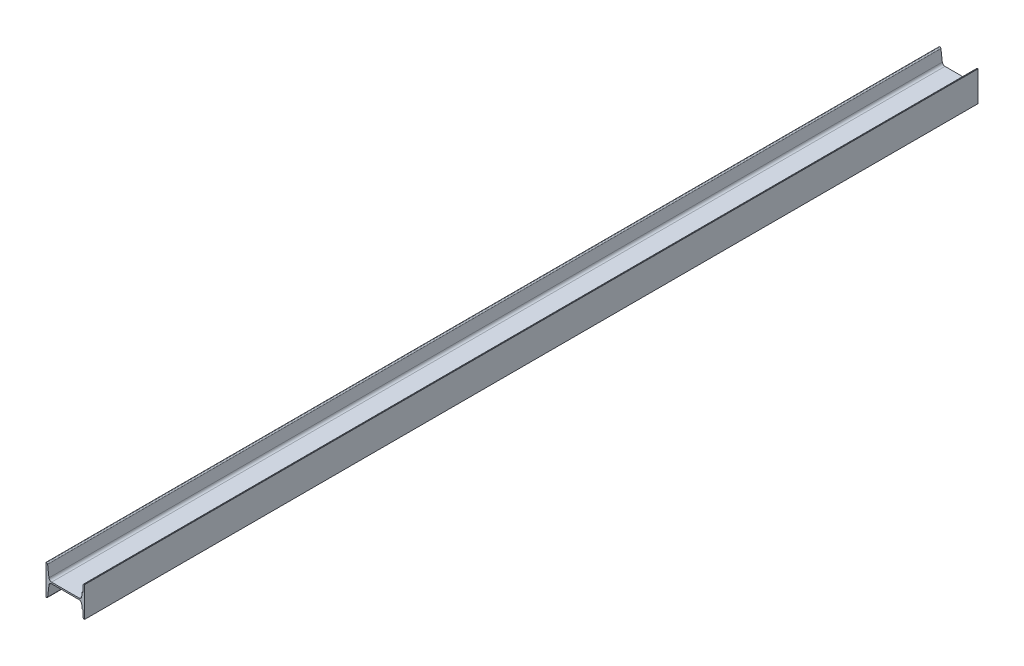
ISO-10303-21;
HEADER;
FILE_DESCRIPTION(('STEP AP214'),'2;1');
FILE_NAME('part.step','',(''),(''),'','','');
FILE_SCHEMA(('AUTOMOTIVE_DESIGN { 1 0 10303 214 1 1 1 1 }'));
ENDSEC;
DATA;
#1=APPLICATION_CONTEXT('core data for automotive mechanical design processes');
#2=APPLICATION_PROTOCOL_DEFINITION('international standard','automotive_design',2000,#1);
#3=PRODUCT_CONTEXT('',#1,'mechanical');
#4=PRODUCT('Part','Part','',(#3));
#5=PRODUCT_RELATED_PRODUCT_CATEGORY('part','',(#4));
#6=PRODUCT_DEFINITION_FORMATION('','',#4);
#7=PRODUCT_DEFINITION_CONTEXT('part definition',#1,'design');
#8=PRODUCT_DEFINITION('design','',#6,#7);
#9=PRODUCT_DEFINITION_SHAPE('','',#8);
#10=(LENGTH_UNIT() NAMED_UNIT(*) SI_UNIT(.MILLI.,.METRE.));
#11=(NAMED_UNIT(*) PLANE_ANGLE_UNIT() SI_UNIT($,.RADIAN.));
#12=(NAMED_UNIT(*) SI_UNIT($,.STERADIAN.) SOLID_ANGLE_UNIT());
#13=UNCERTAINTY_MEASURE_WITH_UNIT(LENGTH_MEASURE(1.E-05),#10,'distance_accuracy_value','');
#14=(GEOMETRIC_REPRESENTATION_CONTEXT(3) GLOBAL_UNCERTAINTY_ASSIGNED_CONTEXT((#13)) GLOBAL_UNIT_ASSIGNED_CONTEXT((#10,
#11,#12)) REPRESENTATION_CONTEXT('',''));
#15=CARTESIAN_POINT('',(0.,0.,0.));
#16=DIRECTION('',(0.,0.,1.));
#17=DIRECTION('',(1.,0.,0.));
#18=AXIS2_PLACEMENT_3D('',#15,#16,#17);
#19=CARTESIAN_POINT('',(112.531380140605,43.4991893124391,-1437.5));
#20=DIRECTION('',(0.,0.,1.));
#21=DIRECTION('',(1.,0.,0.));
#22=AXIS2_PLACEMENT_3D('',#19,#20,#21);
#23=CYLINDRICAL_SURFACE('',#22,3.3749999999963);
#24=CARTESIAN_POINT('',(112.531380140605,43.4991893124391,1337.5));
#25=DIRECTION('',(0.,0.,1.));
#26=DIRECTION('',(1.,0.,0.));
#27=AXIS2_PLACEMENT_3D('',#24,#25,#26);
#28=CIRCLE('',#27,3.3749999999963);
#29=CARTESIAN_POINT('',(112.531380140605,46.8741893124354,1337.5));
#30=VERTEX_POINT('',#29);
#31=CARTESIAN_POINT('',(109.709666996377,45.3508264074622,1337.5));
#32=VERTEX_POINT('',#31);
#33=EDGE_CURVE('E227',#30,#32,#28,.T.);
#34=ORIENTED_EDGE('',*,*,#33,.F.);
#35=DIRECTION('',(0.,0.,1.));
#36=VECTOR('',#35,1.);
#37=CARTESIAN_POINT('',(112.531380140605,46.8741893124354,-1437.5));
#38=LINE('',#37,#36);
#39=CARTESIAN_POINT('',(112.531380140605,46.8741893124354,-1437.5));
#40=VERTEX_POINT('',#39);
#41=EDGE_CURVE('E11',#40,#30,#38,.T.);
#42=ORIENTED_EDGE('',*,*,#41,.F.);
#43=CARTESIAN_POINT('',(112.531380140605,43.4991893124391,-1437.5));
#44=DIRECTION('',(0.,0.,1.));
#45=DIRECTION('',(1.,0.,0.));
#46=AXIS2_PLACEMENT_3D('',#43,#44,#45);
#47=CIRCLE('',#46,3.3749999999963);
#48=CARTESIAN_POINT('',(109.709666996377,45.3508264074622,-1437.5));
#49=VERTEX_POINT('',#48);
#50=EDGE_CURVE('E295',#40,#49,#47,.T.);
#51=ORIENTED_EDGE('',*,*,#50,.T.);
#52=DIRECTION('',(0.,0.,1.));
#53=VECTOR('',#52,1.);
#54=CARTESIAN_POINT('',(109.709666996377,45.3508264074622,-1437.5));
#55=LINE('',#54,#53);
#56=EDGE_CURVE('E37',#49,#32,#55,.T.);
#57=ORIENTED_EDGE('',*,*,#56,.T.);
#58=EDGE_LOOP('',(#34,#42,#51,#57));
#59=FACE_BOUND('',#58,.T.);
#60=ADVANCED_FACE('F34',(#59),#23,.T.);
#61=CARTESIAN_POINT('',(114.209666996383,46.8741893124354,-1437.5));
#62=DIRECTION('',(0.,1.,0.));
#63=DIRECTION('',(0.,0.,1.));
#64=AXIS2_PLACEMENT_3D('',#61,#62,#63);
#65=PLANE('',#64);
#66=DIRECTION('',(-1.,0.,0.));
#67=VECTOR('',#66,1.);
#68=CARTESIAN_POINT('',(114.209666996383,46.8741893124354,1337.5));
#69=LINE('',#68,#67);
#70=CARTESIAN_POINT('',(114.209666996383,46.8741893124354,1337.5));
#71=VERTEX_POINT('',#70);
#72=EDGE_CURVE('E293',#71,#30,#69,.T.);
#73=ORIENTED_EDGE('',*,*,#72,.F.);
#74=DIRECTION('',(0.,0.,1.));
#75=VECTOR('',#74,1.);
#76=CARTESIAN_POINT('',(114.209666996383,46.8741893124354,-1437.5));
#77=LINE('',#76,#75);
#78=CARTESIAN_POINT('',(114.209666996383,46.8741893124354,-1437.5));
#79=VERTEX_POINT('',#78);
#80=EDGE_CURVE('E43',#79,#71,#77,.T.);
#81=ORIENTED_EDGE('',*,*,#80,.F.);
#82=DIRECTION('',(-1.,0.,0.));
#83=VECTOR('',#82,1.);
#84=CARTESIAN_POINT('',(114.209666996383,46.8741893124354,-1437.5));
#85=LINE('',#84,#83);
#86=EDGE_CURVE('E217',#79,#40,#85,.T.);
#87=ORIENTED_EDGE('',*,*,#86,.T.);
#88=ORIENTED_EDGE('',*,*,#41,.T.);
#89=EDGE_LOOP('',(#73,#81,#87,#88));
#90=FACE_BOUND('',#89,.T.);
#91=ADVANCED_FACE('F339',(#90),#65,.T.);
#92=CARTESIAN_POINT('',(114.209666996383,-46.8758106875589,-1437.5));
#93=DIRECTION('',(1.,0.,0.));
#94=DIRECTION('',(0.,0.,-1.));
#95=AXIS2_PLACEMENT_3D('',#92,#93,#94);
#96=PLANE('',#95);
#97=DIRECTION('',(0.,1.,0.));
#98=VECTOR('',#97,1.);
#99=CARTESIAN_POINT('',(114.209666996383,-46.8758106875589,1337.5));
#100=LINE('',#99,#98);
#101=CARTESIAN_POINT('',(114.209666996383,-46.8758106875589,1337.5));
#102=VERTEX_POINT('',#101);
#103=EDGE_CURVE('E204',#102,#71,#100,.T.);
#104=ORIENTED_EDGE('',*,*,#103,.F.);
#105=DIRECTION('',(0.,0.,1.));
#106=VECTOR('',#105,1.);
#107=CARTESIAN_POINT('',(114.209666996383,-46.8758106875589,-1437.5));
#108=LINE('',#107,#106);
#109=CARTESIAN_POINT('',(114.209666996383,-46.8758106875589,-1437.5));
#110=VERTEX_POINT('',#109);
#111=EDGE_CURVE('E199',#110,#102,#108,.T.);
#112=ORIENTED_EDGE('',*,*,#111,.F.);
#113=DIRECTION('',(0.,1.,0.));
#114=VECTOR('',#113,1.);
#115=CARTESIAN_POINT('',(114.209666996383,-46.8758106875589,-1437.5));
#116=LINE('',#115,#114);
#117=EDGE_CURVE('E202',#110,#79,#116,.T.);
#118=ORIENTED_EDGE('',*,*,#117,.T.);
#119=ORIENTED_EDGE('',*,*,#80,.T.);
#120=EDGE_LOOP('',(#104,#112,#118,#119));
#121=FACE_BOUND('',#120,.T.);
#122=ADVANCED_FACE('F201',(#121),#96,.T.);
#123=CARTESIAN_POINT('',(112.531380140608,-46.8758106875589,-1437.5));
#124=DIRECTION('',(0.,-1.,0.));
#125=DIRECTION('',(0.,0.,-1.));
#126=AXIS2_PLACEMENT_3D('',#123,#124,#125);
#127=PLANE('',#126);
#128=DIRECTION('',(1.,0.,0.));
#129=VECTOR('',#128,1.);
#130=CARTESIAN_POINT('',(112.531380140608,-46.8758106875589,1337.5));
#131=LINE('',#130,#129);
#132=CARTESIAN_POINT('',(112.531380140608,-46.8758106875589,1337.5));
#133=VERTEX_POINT('',#132);
#134=EDGE_CURVE('E290',#133,#102,#131,.T.);
#135=ORIENTED_EDGE('',*,*,#134,.F.);
#136=DIRECTION('',(0.,0.,1.));
#137=VECTOR('',#136,1.);
#138=CARTESIAN_POINT('',(112.531380140608,-46.8758106875589,-1437.5));
#139=LINE('',#138,#137);
#140=CARTESIAN_POINT('',(112.531380140608,-46.8758106875589,-1437.5));
#141=VERTEX_POINT('',#140);
#142=EDGE_CURVE('E209',#141,#133,#139,.T.);
#143=ORIENTED_EDGE('',*,*,#142,.F.);
#144=DIRECTION('',(1.,0.,0.));
#145=VECTOR('',#144,1.);
#146=CARTESIAN_POINT('',(112.531380140608,-46.8758106875589,-1437.5));
#147=LINE('',#146,#145);
#148=EDGE_CURVE('E215',#141,#110,#147,.T.);
#149=ORIENTED_EDGE('',*,*,#148,.T.);
#150=ORIENTED_EDGE('',*,*,#111,.T.);
#151=EDGE_LOOP('',(#135,#143,#149,#150));
#152=FACE_BOUND('',#151,.T.);
#153=ADVANCED_FACE('F219',(#152),#127,.T.);
#154=CARTESIAN_POINT('',(112.531380140608,-43.5008106875589,-1437.5));
#155=DIRECTION('',(0.,0.,1.));
#156=DIRECTION('',(1.,0.,0.));
#157=AXIS2_PLACEMENT_3D('',#154,#155,#156);
#158=CYLINDRICAL_SURFACE('',#157,3.375);
#159=CARTESIAN_POINT('',(112.531380140608,-43.5008106875589,1337.5));
#160=DIRECTION('',(0.,0.,1.));
#161=DIRECTION('',(1.,0.,0.));
#162=AXIS2_PLACEMENT_3D('',#159,#160,#161);
#163=CIRCLE('',#162,3.375);
#164=CARTESIAN_POINT('',(109.709666996377,-45.3524477825839,1337.5));
#165=VERTEX_POINT('',#164);
#166=EDGE_CURVE('E287',#165,#133,#163,.T.);
#167=ORIENTED_EDGE('',*,*,#166,.F.);
#168=DIRECTION('',(0.,0.,1.));
#169=VECTOR('',#168,1.);
#170=CARTESIAN_POINT('',(109.709666996377,-45.3524477825839,-1437.5));
#171=LINE('',#170,#169);
#172=CARTESIAN_POINT('',(109.709666996377,-45.3524477825839,-1437.5));
#173=VERTEX_POINT('',#172);
#174=EDGE_CURVE('E299',#173,#165,#171,.T.);
#175=ORIENTED_EDGE('',*,*,#174,.F.);
#176=CARTESIAN_POINT('',(112.531380140608,-43.5008106875589,-1437.5));
#177=DIRECTION('',(0.,0.,1.));
#178=DIRECTION('',(1.,0.,0.));
#179=AXIS2_PLACEMENT_3D('',#176,#177,#178);
#180=CIRCLE('',#179,3.375);
#181=EDGE_CURVE('E220',#173,#141,#180,.T.);
#182=ORIENTED_EDGE('',*,*,#181,.T.);
#183=ORIENTED_EDGE('',*,*,#142,.T.);
#184=EDGE_LOOP('',(#167,#175,#182,#183));
#185=FACE_BOUND('',#184,.T.);
#186=ADVANCED_FACE('F352',(#185),#158,.T.);
#187=CARTESIAN_POINT('',(109.709666996377,-22.5008106875744,-1437.5));
#188=DIRECTION('',(-1.,0.,0.));
#189=DIRECTION('',(0.,0.,1.));
#190=AXIS2_PLACEMENT_3D('',#187,#188,#189);
#191=PLANE('',#190);
#192=DIRECTION('',(0.,-1.,0.));
#193=VECTOR('',#192,1.);
#194=CARTESIAN_POINT('',(109.709666996377,-22.5008106875744,1337.5));
#195=LINE('',#194,#193);
#196=CARTESIAN_POINT('',(109.709666996377,-22.5008106875744,1337.5));
#197=VERTEX_POINT('',#196);
#198=EDGE_CURVE('E284',#197,#165,#195,.T.);
#199=ORIENTED_EDGE('',*,*,#198,.F.);
#200=DIRECTION('',(0.,0.,1.));
#201=VECTOR('',#200,1.);
#202=CARTESIAN_POINT('',(109.709666996377,-22.5008106875744,-1437.5));
#203=LINE('',#202,#201);
#204=CARTESIAN_POINT('',(109.709666996377,-22.5008106875744,-1437.5));
#205=VERTEX_POINT('',#204);
#206=EDGE_CURVE('E301',#205,#197,#203,.T.);
#207=ORIENTED_EDGE('',*,*,#206,.F.);
#208=DIRECTION('',(0.,-1.,0.));
#209=VECTOR('',#208,1.);
#210=CARTESIAN_POINT('',(109.709666996377,-22.5008106875744,-1437.5));
#211=LINE('',#210,#209);
#212=EDGE_CURVE('E222',#205,#173,#211,.T.);
#213=ORIENTED_EDGE('',*,*,#212,.T.);
#214=ORIENTED_EDGE('',*,*,#174,.T.);
#215=EDGE_LOOP('',(#199,#207,#213,#214));
#216=FACE_BOUND('',#215,.T.);
#217=ADVANCED_FACE('F355',(#216),#191,.T.);
#218=CARTESIAN_POINT('',(106.612166996365,-22.5008106875744,-1437.5));
#219=DIRECTION('',(0.,-1.,0.));
#220=DIRECTION('',(0.,0.,-1.));
#221=AXIS2_PLACEMENT_3D('',#218,#219,#220);
#222=PLANE('',#221);
#223=DIRECTION('',(1.,0.,0.));
#224=VECTOR('',#223,1.);
#225=CARTESIAN_POINT('',(106.612166996365,-22.5008106875744,1337.5));
#226=LINE('',#225,#224);
#227=CARTESIAN_POINT('',(106.612166996365,-22.5008106875744,1337.5));
#228=VERTEX_POINT('',#227);
#229=EDGE_CURVE('E281',#228,#197,#226,.T.);
#230=ORIENTED_EDGE('',*,*,#229,.F.);
#231=DIRECTION('',(0.,0.,1.));
#232=VECTOR('',#231,1.);
#233=CARTESIAN_POINT('',(106.612166996365,-22.5008106875744,-1437.5));
#234=LINE('',#233,#232);
#235=CARTESIAN_POINT('',(106.612166996365,-22.5008106875744,-1437.5));
#236=VERTEX_POINT('',#235);
#237=EDGE_CURVE('E303',#236,#228,#234,.T.);
#238=ORIENTED_EDGE('',*,*,#237,.F.);
#239=DIRECTION('',(1.,0.,0.));
#240=VECTOR('',#239,1.);
#241=CARTESIAN_POINT('',(106.612166996365,-22.5008106875744,-1437.5));
#242=LINE('',#241,#240);
#243=EDGE_CURVE('E645',#236,#205,#242,.T.);
#244=ORIENTED_EDGE('',*,*,#243,.T.);
#245=ORIENTED_EDGE('',*,*,#206,.T.);
#246=EDGE_LOOP('',(#230,#238,#244,#245));
#247=FACE_BOUND('',#246,.T.);
#248=ADVANCED_FACE('F359',(#247),#222,.T.);
#249=CARTESIAN_POINT('',(105.054213227965,-9.51786261747593,-1437.5));
#250=DIRECTION('',(-0.99287683848703,-0.119145220617527,0.));
#251=DIRECTION('',(0.119145220617527,-0.992876838487031,0.));
#252=AXIS2_PLACEMENT_3D('',#249,#250,#251);
#253=PLANE('',#252);
#254=DIRECTION('',(0.119145220617527,-0.99287683848703,0.));
#255=VECTOR('',#254,1.);
#256=CARTESIAN_POINT('',(105.054213227965,-9.51786261747593,1337.5));
#257=LINE('',#256,#255);
#258=CARTESIAN_POINT('',(105.054213227965,-9.51786261747592,1337.5));
#259=VERTEX_POINT('',#258);
#260=EDGE_CURVE('E278',#259,#228,#257,.T.);
#261=ORIENTED_EDGE('',*,*,#260,.F.);
#262=DIRECTION('',(0.,0.,1.));
#263=VECTOR('',#262,1.);
#264=CARTESIAN_POINT('',(105.054213227965,-9.51786261747592,-1437.5));
#265=LINE('',#264,#263);
#266=CARTESIAN_POINT('',(105.054213227965,-9.51786261747592,-1437.5));
#267=VERTEX_POINT('',#266);
#268=EDGE_CURVE('E305',#267,#259,#265,.T.);
#269=ORIENTED_EDGE('',*,*,#268,.F.);
#270=DIRECTION('',(0.119145220617527,-0.99287683848703,0.));
#271=VECTOR('',#270,1.);
#272=CARTESIAN_POINT('',(105.054213227965,-9.51786261747593,-1437.5));
#273=LINE('',#272,#271);
#274=EDGE_CURVE('E649',#267,#236,#273,.T.);
#275=ORIENTED_EDGE('',*,*,#274,.T.);
#276=ORIENTED_EDGE('',*,*,#237,.T.);
#277=EDGE_LOOP('',(#261,#269,#275,#276));
#278=FACE_BOUND('',#277,.T.);
#279=ADVANCED_FACE('F363',(#278),#253,.T.);
#280=CARTESIAN_POINT('',(96.8629793104312,-10.5008106875724,-1437.5));
#281=DIRECTION('',(0.,0.,1.));
#282=DIRECTION('',(1.,0.,0.));
#283=AXIS2_PLACEMENT_3D('',#280,#281,#282);
#284=CYLINDRICAL_SURFACE('',#283,8.2500000000162);
#285=CARTESIAN_POINT('',(96.8629793104312,-10.5008106875724,1337.5));
#286=DIRECTION('',(0.,0.,-1.));
#287=DIRECTION('',(-1.,0.,0.));
#288=AXIS2_PLACEMENT_3D('',#285,#286,#287);
#289=CIRCLE('',#288,8.2500000000162);
#290=CARTESIAN_POINT('',(96.8629793104312,-2.25081068755624,1337.5));
#291=VERTEX_POINT('',#290);
#292=EDGE_CURVE('E275',#291,#259,#289,.T.);
#293=ORIENTED_EDGE('',*,*,#292,.F.);
#294=DIRECTION('',(0.,0.,1.));
#295=VECTOR('',#294,1.);
#296=CARTESIAN_POINT('',(96.8629793104312,-2.25081068755624,-1437.5));
#297=LINE('',#296,#295);
#298=CARTESIAN_POINT('',(96.8629793104312,-2.25081068755624,-1437.5));
#299=VERTEX_POINT('',#298);
#300=EDGE_CURVE('E307',#299,#291,#297,.T.);
#301=ORIENTED_EDGE('',*,*,#300,.F.);
#302=CARTESIAN_POINT('',(96.8629793104312,-10.5008106875724,-1437.5));
#303=DIRECTION('',(0.,0.,-1.));
#304=DIRECTION('',(-1.,0.,0.));
#305=AXIS2_PLACEMENT_3D('',#302,#303,#304);
#306=CIRCLE('',#305,8.2500000000162);
#307=EDGE_CURVE('E638',#299,#267,#306,.T.);
#308=ORIENTED_EDGE('',*,*,#307,.T.);
#309=ORIENTED_EDGE('',*,*,#268,.T.);
#310=EDGE_LOOP('',(#293,#301,#308,#309));
#311=FACE_BOUND('',#310,.T.);
#312=ADVANCED_FACE('F367',(#311),#284,.F.);
#313=CARTESIAN_POINT('',(11.5563546823102,-2.25081068755624,-1437.5));
#314=DIRECTION('',(0.,-1.,0.));
#315=DIRECTION('',(0.,0.,-1.));
#316=AXIS2_PLACEMENT_3D('',#313,#314,#315);
#317=PLANE('',#316);
#318=DIRECTION('',(1.,0.,0.));
#319=VECTOR('',#318,1.);
#320=CARTESIAN_POINT('',(11.5563546823102,-2.25081068755624,1337.5));
#321=LINE('',#320,#319);
#322=CARTESIAN_POINT('',(11.5563546823102,-2.25081068755624,1337.5));
#323=VERTEX_POINT('',#322);
#324=EDGE_CURVE('E272',#323,#291,#321,.T.);
#325=ORIENTED_EDGE('',*,*,#324,.F.);
#326=DIRECTION('',(0.,0.,1.));
#327=VECTOR('',#326,1.);
#328=CARTESIAN_POINT('',(11.5563546823102,-2.25081068755624,-1437.5));
#329=LINE('',#328,#327);
#330=CARTESIAN_POINT('',(11.5563546823102,-2.25081068755624,-1437.5));
#331=VERTEX_POINT('',#330);
#332=EDGE_CURVE('E309',#331,#323,#329,.T.);
#333=ORIENTED_EDGE('',*,*,#332,.F.);
#334=DIRECTION('',(1.,0.,0.));
#335=VECTOR('',#334,1.);
#336=CARTESIAN_POINT('',(11.5563546823102,-2.25081068755624,-1437.5));
#337=LINE('',#336,#335);
#338=EDGE_CURVE('E634',#331,#299,#337,.T.);
#339=ORIENTED_EDGE('',*,*,#338,.T.);
#340=ORIENTED_EDGE('',*,*,#300,.T.);
#341=EDGE_LOOP('',(#325,#333,#339,#340));
#342=FACE_BOUND('',#341,.T.);
#343=ADVANCED_FACE('F371',(#342),#317,.T.);
#344=CARTESIAN_POINT('',(11.5563546823102,-10.5008106875554,-1437.5));
#345=DIRECTION('',(0.,0.,1.));
#346=DIRECTION('',(1.,0.,0.));
#347=AXIS2_PLACEMENT_3D('',#344,#345,#346);
#348=CYLINDRICAL_SURFACE('',#347,8.24999999999917);
#349=CARTESIAN_POINT('',(11.5563546823102,-10.5008106875554,1337.5));
#350=DIRECTION('',(0.,0.,-1.));
#351=DIRECTION('',(-1.,0.,0.));
#352=AXIS2_PLACEMENT_3D('',#349,#350,#351);
#353=CIRCLE('',#352,8.24999999999917);
#354=CARTESIAN_POINT('',(3.36512076479385,-9.51786261745378,1337.5));
#355=VERTEX_POINT('',#354);
#356=EDGE_CURVE('E269',#355,#323,#353,.T.);
#357=ORIENTED_EDGE('',*,*,#356,.F.);
#358=DIRECTION('',(0.,0.,1.));
#359=VECTOR('',#358,1.);
#360=CARTESIAN_POINT('',(3.36512076479385,-9.51786261745378,-1437.5));
#361=LINE('',#360,#359);
#362=CARTESIAN_POINT('',(3.36512076479385,-9.51786261745378,-1437.5));
#363=VERTEX_POINT('',#362);
#364=EDGE_CURVE('E311',#363,#355,#361,.T.);
#365=ORIENTED_EDGE('',*,*,#364,.F.);
#366=CARTESIAN_POINT('',(11.5563546823102,-10.5008106875554,-1437.5));
#367=DIRECTION('',(0.,0.,-1.));
#368=DIRECTION('',(-1.,0.,0.));
#369=AXIS2_PLACEMENT_3D('',#366,#367,#368);
#370=CIRCLE('',#369,8.24999999999917);
#371=EDGE_CURVE('E655',#363,#331,#370,.T.);
#372=ORIENTED_EDGE('',*,*,#371,.T.);
#373=ORIENTED_EDGE('',*,*,#332,.T.);
#374=EDGE_LOOP('',(#357,#365,#372,#373));
#375=FACE_BOUND('',#374,.T.);
#376=ADVANCED_FACE('F375',(#375),#348,.F.);
#377=CARTESIAN_POINT('',(-0.7610868179675,-43.9029258071431,-1437.5));
#378=DIRECTION('',(0.992876838486927,-0.119145220618392,0.));
#379=DIRECTION('',(0.119145220618392,0.992876838486927,0.));
#380=AXIS2_PLACEMENT_3D('',#377,#378,#379);
#381=PLANE('',#380);
#382=DIRECTION('',(0.119145220618392,0.992876838486927,0.));
#383=VECTOR('',#382,1.);
#384=CARTESIAN_POINT('',(-0.7610868179675,-43.9029258071431,1337.5));
#385=LINE('',#384,#383);
#386=CARTESIAN_POINT('',(-0.7610868179675,-43.9029258071431,1337.5));
#387=VERTEX_POINT('',#386);
#388=EDGE_CURVE('E266',#387,#355,#385,.T.);
#389=ORIENTED_EDGE('',*,*,#388,.F.);
#390=DIRECTION('',(0.,0.,1.));
#391=VECTOR('',#390,1.);
#392=CARTESIAN_POINT('',(-0.7610868179675,-43.9029258071431,-1437.5));
#393=LINE('',#392,#391);
#394=CARTESIAN_POINT('',(-0.7610868179675,-43.9029258071431,-1437.5));
#395=VERTEX_POINT('',#394);
#396=EDGE_CURVE('E313',#395,#387,#393,.T.);
#397=ORIENTED_EDGE('',*,*,#396,.F.);
#398=DIRECTION('',(0.119145220618392,0.992876838486927,0.));
#399=VECTOR('',#398,1.);
#400=CARTESIAN_POINT('',(-0.7610868179675,-43.9029258071431,-1437.5));
#401=LINE('',#400,#399);
#402=EDGE_CURVE('E627',#395,#363,#401,.T.);
#403=ORIENTED_EDGE('',*,*,#402,.T.);
#404=ORIENTED_EDGE('',*,*,#364,.T.);
#405=EDGE_LOOP('',(#389,#397,#403,#404));
#406=FACE_BOUND('',#405,.T.);
#407=ADVANCED_FACE('F379',(#406),#381,.T.);
#408=CARTESIAN_POINT('',(-4.11204614786402,-43.5008106875557,-1437.5));
#409=DIRECTION('',(0.,0.,1.));
#410=DIRECTION('',(1.,0.,0.));
#411=AXIS2_PLACEMENT_3D('',#408,#409,#410);
#412=CYLINDRICAL_SURFACE('',#411,3.37500000000316);
#413=CARTESIAN_POINT('',(-4.11204614786402,-43.5008106875557,1337.5));
#414=DIRECTION('',(0.,0.,1.));
#415=DIRECTION('',(1.,0.,0.));
#416=AXIS2_PLACEMENT_3D('',#413,#414,#415);
#417=CIRCLE('',#416,3.37500000000316);
#418=CARTESIAN_POINT('',(-4.11204614786402,-46.8758106875589,1337.5));
#419=VERTEX_POINT('',#418);
#420=EDGE_CURVE('E263',#419,#387,#417,.T.);
#421=ORIENTED_EDGE('',*,*,#420,.F.);
#422=DIRECTION('',(0.,0.,1.));
#423=VECTOR('',#422,1.);
#424=CARTESIAN_POINT('',(-4.11204614786402,-46.8758106875589,-1437.5));
#425=LINE('',#424,#423);
#426=CARTESIAN_POINT('',(-4.11204614786402,-46.8758106875589,-1437.5));
#427=VERTEX_POINT('',#426);
#428=EDGE_CURVE('E315',#427,#419,#425,.T.);
#429=ORIENTED_EDGE('',*,*,#428,.F.);
#430=CARTESIAN_POINT('',(-4.11204614786402,-43.5008106875557,-1437.5));
#431=DIRECTION('',(0.,0.,1.));
#432=DIRECTION('',(1.,0.,0.));
#433=AXIS2_PLACEMENT_3D('',#430,#431,#432);
#434=CIRCLE('',#433,3.37500000000316);
#435=EDGE_CURVE('E623',#427,#395,#434,.T.);
#436=ORIENTED_EDGE('',*,*,#435,.T.);
#437=ORIENTED_EDGE('',*,*,#396,.T.);
#438=EDGE_LOOP('',(#421,#429,#436,#437));
#439=FACE_BOUND('',#438,.T.);
#440=ADVANCED_FACE('F383',(#439),#412,.T.);
#441=CARTESIAN_POINT('',(-5.79033300361652,-46.8758106875589,-1437.5));
#442=DIRECTION('',(0.,-1.,0.));
#443=DIRECTION('',(0.,0.,-1.));
#444=AXIS2_PLACEMENT_3D('',#441,#442,#443);
#445=PLANE('',#444);
#446=DIRECTION('',(1.,0.,0.));
#447=VECTOR('',#446,1.);
#448=CARTESIAN_POINT('',(-5.79033300361652,-46.8758106875589,1337.5));
#449=LINE('',#448,#447);
#450=CARTESIAN_POINT('',(-5.79033300361652,-46.8758106875589,1337.5));
#451=VERTEX_POINT('',#450);
#452=EDGE_CURVE('E260',#451,#419,#449,.T.);
#453=ORIENTED_EDGE('',*,*,#452,.F.);
#454=DIRECTION('',(0.,0.,1.));
#455=VECTOR('',#454,1.);
#456=CARTESIAN_POINT('',(-5.79033300361652,-46.8758106875589,-1437.5));
#457=LINE('',#456,#455);
#458=CARTESIAN_POINT('',(-5.79033300361652,-46.8758106875589,-1437.5));
#459=VERTEX_POINT('',#458);
#460=EDGE_CURVE('E317',#459,#451,#457,.T.);
#461=ORIENTED_EDGE('',*,*,#460,.F.);
#462=DIRECTION('',(1.,0.,0.));
#463=VECTOR('',#462,1.);
#464=CARTESIAN_POINT('',(-5.79033300361652,-46.8758106875589,-1437.5));
#465=LINE('',#464,#463);
#466=EDGE_CURVE('E659',#459,#427,#465,.T.);
#467=ORIENTED_EDGE('',*,*,#466,.T.);
#468=ORIENTED_EDGE('',*,*,#428,.T.);
#469=EDGE_LOOP('',(#453,#461,#467,#468));
#470=FACE_BOUND('',#469,.T.);
#471=ADVANCED_FACE('F387',(#470),#445,.T.);
#472=CARTESIAN_POINT('',(-5.79033300361653,46.8741893124354,-1437.5));
#473=DIRECTION('',(-1.,0.,0.));
#474=DIRECTION('',(0.,-1.,0.));
#475=AXIS2_PLACEMENT_3D('',#472,#473,#474);
#476=PLANE('',#475);
#477=DIRECTION('',(0.,-1.,0.));
#478=VECTOR('',#477,1.);
#479=CARTESIAN_POINT('',(-5.79033300361653,46.8741893124354,1337.5));
#480=LINE('',#479,#478);
#481=CARTESIAN_POINT('',(-5.79033300361653,46.8741893124354,1337.5));
#482=VERTEX_POINT('',#481);
#483=EDGE_CURVE('E257',#482,#451,#480,.T.);
#484=ORIENTED_EDGE('',*,*,#483,.F.);
#485=DIRECTION('',(0.,0.,1.));
#486=VECTOR('',#485,1.);
#487=CARTESIAN_POINT('',(-5.79033300361653,46.8741893124354,-1437.5));
#488=LINE('',#487,#486);
#489=CARTESIAN_POINT('',(-5.79033300361653,46.8741893124354,-1437.5));
#490=VERTEX_POINT('',#489);
#491=EDGE_CURVE('E319',#490,#482,#488,.T.);
#492=ORIENTED_EDGE('',*,*,#491,.F.);
#493=DIRECTION('',(0.,-1.,0.));
#494=VECTOR('',#493,1.);
#495=CARTESIAN_POINT('',(-5.79033300361653,46.8741893124354,-1437.5));
#496=LINE('',#495,#494);
#497=EDGE_CURVE('E616',#490,#459,#496,.T.);
#498=ORIENTED_EDGE('',*,*,#497,.T.);
#499=ORIENTED_EDGE('',*,*,#460,.T.);
#500=EDGE_LOOP('',(#484,#492,#498,#499));
#501=FACE_BOUND('',#500,.T.);
#502=ADVANCED_FACE('F391',(#501),#476,.T.);
#503=CARTESIAN_POINT('',(-4.11204614786714,46.8741893124354,-1437.5));
#504=DIRECTION('',(0.,1.,0.));
#505=DIRECTION('',(0.,0.,1.));
#506=AXIS2_PLACEMENT_3D('',#503,#504,#505);
#507=PLANE('',#506);
#508=DIRECTION('',(-1.,0.,0.));
#509=VECTOR('',#508,1.);
#510=CARTESIAN_POINT('',(-4.11204614786714,46.8741893124354,1337.5));
#511=LINE('',#510,#509);
#512=CARTESIAN_POINT('',(-4.11204614786714,46.8741893124354,1337.5));
#513=VERTEX_POINT('',#512);
#514=EDGE_CURVE('E254',#513,#482,#511,.T.);
#515=ORIENTED_EDGE('',*,*,#514,.F.);
#516=DIRECTION('',(0.,0.,1.));
#517=VECTOR('',#516,1.);
#518=CARTESIAN_POINT('',(-4.11204614786714,46.8741893124354,-1437.5));
#519=LINE('',#518,#517);
#520=CARTESIAN_POINT('',(-4.11204614786714,46.8741893124354,-1437.5));
#521=VERTEX_POINT('',#520);
#522=EDGE_CURVE('E321',#521,#513,#519,.T.);
#523=ORIENTED_EDGE('',*,*,#522,.F.);
#524=DIRECTION('',(-1.,0.,0.));
#525=VECTOR('',#524,1.);
#526=CARTESIAN_POINT('',(-4.11204614786714,46.8741893124354,-1437.5));
#527=LINE('',#526,#525);
#528=EDGE_CURVE('E612',#521,#490,#527,.T.);
#529=ORIENTED_EDGE('',*,*,#528,.T.);
#530=ORIENTED_EDGE('',*,*,#491,.T.);
#531=EDGE_LOOP('',(#515,#523,#529,#530));
#532=FACE_BOUND('',#531,.T.);
#533=ADVANCED_FACE('F395',(#532),#507,.T.);
#534=CARTESIAN_POINT('',(-4.11204614786714,43.4991893124338,-1437.5));
#535=DIRECTION('',(0.,0.,1.));
#536=DIRECTION('',(1.,0.,0.));
#537=AXIS2_PLACEMENT_3D('',#534,#535,#536);
#538=CYLINDRICAL_SURFACE('',#537,3.37500000000158);
#539=CARTESIAN_POINT('',(-4.11204614786714,43.4991893124338,1337.5));
#540=DIRECTION('',(0.,0.,1.));
#541=DIRECTION('',(1.,0.,0.));
#542=AXIS2_PLACEMENT_3D('',#539,#540,#541);
#543=CIRCLE('',#542,3.37500000000158);
#544=CARTESIAN_POINT('',(-0.761086817972254,43.9013044320215,1337.5));
#545=VERTEX_POINT('',#544);
#546=EDGE_CURVE('E251',#545,#513,#543,.T.);
#547=ORIENTED_EDGE('',*,*,#546,.F.);
#548=DIRECTION('',(0.,0.,1.));
#549=VECTOR('',#548,1.);
#550=CARTESIAN_POINT('',(-0.761086817972254,43.9013044320215,-1437.5));
#551=LINE('',#550,#549);
#552=CARTESIAN_POINT('',(-0.761086817972254,43.9013044320215,-1437.5));
#553=VERTEX_POINT('',#552);
#554=EDGE_CURVE('E323',#553,#545,#551,.T.);
#555=ORIENTED_EDGE('',*,*,#554,.F.);
#556=CARTESIAN_POINT('',(-4.11204614786714,43.4991893124338,-1437.5));
#557=DIRECTION('',(0.,0.,1.));
#558=DIRECTION('',(1.,0.,0.));
#559=AXIS2_PLACEMENT_3D('',#556,#557,#558);
#560=CIRCLE('',#559,3.37500000000158);
#561=EDGE_CURVE('E663',#553,#521,#560,.T.);
#562=ORIENTED_EDGE('',*,*,#561,.T.);
#563=ORIENTED_EDGE('',*,*,#522,.T.);
#564=EDGE_LOOP('',(#547,#555,#562,#563));
#565=FACE_BOUND('',#564,.T.);
#566=ADVANCED_FACE('F399',(#565),#538,.T.);
#567=CARTESIAN_POINT('',(3.36512076479409,9.51624124233116,-1437.5));
#568=DIRECTION('',(0.99287683848691,0.11914522061853,0.));
#569=DIRECTION('',(-0.11914522061853,0.99287683848691,0.));
#570=AXIS2_PLACEMENT_3D('',#567,#568,#569);
#571=PLANE('',#570);
#572=DIRECTION('',(-0.11914522061853,0.99287683848691,0.));
#573=VECTOR('',#572,1.);
#574=CARTESIAN_POINT('',(3.36512076479409,9.51624124233116,1337.5));
#575=LINE('',#574,#573);
#576=CARTESIAN_POINT('',(3.36512076479409,9.51624124233115,1337.5));
#577=VERTEX_POINT('',#576);
#578=EDGE_CURVE('E248',#577,#545,#575,.T.);
#579=ORIENTED_EDGE('',*,*,#578,.F.);
#580=DIRECTION('',(0.,0.,1.));
#581=VECTOR('',#580,1.);
#582=CARTESIAN_POINT('',(3.36512076479409,9.51624124233115,-1437.5));
#583=LINE('',#582,#581);
#584=CARTESIAN_POINT('',(3.36512076479409,9.51624124233115,-1437.5));
#585=VERTEX_POINT('',#584);
#586=EDGE_CURVE('E325',#585,#577,#583,.T.);
#587=ORIENTED_EDGE('',*,*,#586,.F.);
#588=DIRECTION('',(-0.11914522061853,0.99287683848691,0.));
#589=VECTOR('',#588,1.);
#590=CARTESIAN_POINT('',(3.36512076479409,9.51624124233116,-1437.5));
#591=LINE('',#590,#589);
#592=EDGE_CURVE('E605',#585,#553,#591,.T.);
#593=ORIENTED_EDGE('',*,*,#592,.T.);
#594=ORIENTED_EDGE('',*,*,#554,.T.);
#595=EDGE_LOOP('',(#579,#587,#593,#594));
#596=FACE_BOUND('',#595,.T.);
#597=ADVANCED_FACE('F403',(#596),#571,.T.);
#598=CARTESIAN_POINT('',(11.5563546823094,10.4991893124338,-1437.5));
#599=DIRECTION('',(0.,0.,1.));
#600=DIRECTION('',(1.,0.,0.));
#601=AXIS2_PLACEMENT_3D('',#598,#599,#600);
#602=CYLINDRICAL_SURFACE('',#601,8.24999999999834);
#603=CARTESIAN_POINT('',(11.5563546823094,10.4991893124338,1337.5));
#604=DIRECTION('',(0.,0.,-1.));
#605=DIRECTION('',(-1.,0.,0.));
#606=AXIS2_PLACEMENT_3D('',#603,#604,#605);
#607=CIRCLE('',#606,8.24999999999834);
#608=CARTESIAN_POINT('',(11.5563546823094,2.2491893124355,1337.5));
#609=VERTEX_POINT('',#608);
#610=EDGE_CURVE('E245',#609,#577,#607,.T.);
#611=ORIENTED_EDGE('',*,*,#610,.F.);
#612=DIRECTION('',(0.,0.,1.));
#613=VECTOR('',#612,1.);
#614=CARTESIAN_POINT('',(11.5563546823094,2.2491893124355,-1437.5));
#615=LINE('',#614,#613);
#616=CARTESIAN_POINT('',(11.5563546823094,2.2491893124355,-1437.5));
#617=VERTEX_POINT('',#616);
#618=EDGE_CURVE('E327',#617,#609,#615,.T.);
#619=ORIENTED_EDGE('',*,*,#618,.F.);
#620=CARTESIAN_POINT('',(11.5563546823094,10.4991893124338,-1437.5));
#621=DIRECTION('',(0.,0.,-1.));
#622=DIRECTION('',(-1.,0.,0.));
#623=AXIS2_PLACEMENT_3D('',#620,#621,#622);
#624=CIRCLE('',#623,8.24999999999834);
#625=EDGE_CURVE('E601',#617,#585,#624,.T.);
#626=ORIENTED_EDGE('',*,*,#625,.T.);
#627=ORIENTED_EDGE('',*,*,#586,.T.);
#628=EDGE_LOOP('',(#611,#619,#626,#627));
#629=FACE_BOUND('',#628,.T.);
#630=ADVANCED_FACE('F407',(#629),#602,.F.);
#631=CARTESIAN_POINT('',(96.8629793104304,2.24918931243551,-1437.5));
#632=DIRECTION('',(0.,1.,0.));
#633=DIRECTION('',(-1.,0.,0.));
#634=AXIS2_PLACEMENT_3D('',#631,#632,#633);
#635=PLANE('',#634);
#636=DIRECTION('',(-1.,0.,0.));
#637=VECTOR('',#636,1.);
#638=CARTESIAN_POINT('',(96.8629793104304,2.24918931243551,1337.5));
#639=LINE('',#638,#637);
#640=CARTESIAN_POINT('',(96.8629793104304,2.24918931243551,1337.5));
#641=VERTEX_POINT('',#640);
#642=EDGE_CURVE('E242',#641,#609,#639,.T.);
#643=ORIENTED_EDGE('',*,*,#642,.F.);
#644=DIRECTION('',(0.,0.,1.));
#645=VECTOR('',#644,1.);
#646=CARTESIAN_POINT('',(96.8629793104304,2.24918931243551,-1437.5));
#647=LINE('',#646,#645);
#648=CARTESIAN_POINT('',(96.8629793104304,2.24918931243551,-1437.5));
#649=VERTEX_POINT('',#648);
#650=EDGE_CURVE('E329',#649,#641,#647,.T.);
#651=ORIENTED_EDGE('',*,*,#650,.F.);
#652=DIRECTION('',(-1.,0.,0.));
#653=VECTOR('',#652,1.);
#654=CARTESIAN_POINT('',(96.8629793104304,2.24918931243551,-1437.5));
#655=LINE('',#654,#653);
#656=EDGE_CURVE('E667',#649,#617,#655,.T.);
#657=ORIENTED_EDGE('',*,*,#656,.T.);
#658=ORIENTED_EDGE('',*,*,#618,.T.);
#659=EDGE_LOOP('',(#643,#651,#657,#658));
#660=FACE_BOUND('',#659,.T.);
#661=ADVANCED_FACE('F411',(#660),#635,.T.);
#662=CARTESIAN_POINT('',(96.8629793104304,10.4991893124355,-1437.5));
#663=DIRECTION('',(0.,0.,1.));
#664=DIRECTION('',(1.,0.,0.));
#665=AXIS2_PLACEMENT_3D('',#662,#663,#664);
#666=CYLINDRICAL_SURFACE('',#665,8.25);
#667=CARTESIAN_POINT('',(96.8629793104304,10.4991893124355,1337.5));
#668=DIRECTION('',(0.,0.,-1.));
#669=DIRECTION('',(-1.,0.,0.));
#670=AXIS2_PLACEMENT_3D('',#667,#668,#669);
#671=CIRCLE('',#670,8.25);
#672=CARTESIAN_POINT('',(105.054213227266,9.51624123665746,1337.5));
#673=VERTEX_POINT('',#672);
#674=EDGE_CURVE('E239',#673,#641,#671,.T.);
#675=ORIENTED_EDGE('',*,*,#674,.F.);
#676=DIRECTION('',(0.,0.,1.));
#677=VECTOR('',#676,1.);
#678=CARTESIAN_POINT('',(105.054213227266,9.51624123665746,-1437.5));
#679=LINE('',#678,#677);
#680=CARTESIAN_POINT('',(105.054213227266,9.51624123665746,-1437.5));
#681=VERTEX_POINT('',#680);
#682=EDGE_CURVE('E331',#681,#673,#679,.T.);
#683=ORIENTED_EDGE('',*,*,#682,.F.);
#684=CARTESIAN_POINT('',(96.8629793104304,10.4991893124355,-1437.5));
#685=DIRECTION('',(0.,0.,-1.));
#686=DIRECTION('',(-1.,0.,0.));
#687=AXIS2_PLACEMENT_3D('',#684,#685,#686);
#688=CIRCLE('',#687,8.25);
#689=EDGE_CURVE('E594',#681,#649,#688,.T.);
#690=ORIENTED_EDGE('',*,*,#689,.T.);
#691=ORIENTED_EDGE('',*,*,#650,.T.);
#692=EDGE_LOOP('',(#675,#683,#690,#691));
#693=FACE_BOUND('',#692,.T.);
#694=ADVANCED_FACE('F415',(#693),#666,.F.);
#695=CARTESIAN_POINT('',(106.649478564355,22.4991893124355,-1437.5));
#696=DIRECTION('',(-0.99253542309204,0.121956688654231,0.));
#697=DIRECTION('',(-0.121956688654231,-0.99253542309204,0.));
#698=AXIS2_PLACEMENT_3D('',#695,#696,#697);
#699=PLANE('',#698);
#700=DIRECTION('',(-0.121956688654231,-0.99253542309204,0.));
#701=VECTOR('',#700,1.);
#702=CARTESIAN_POINT('',(106.649478564355,22.4991893124355,1337.5));
#703=LINE('',#702,#701);
#704=CARTESIAN_POINT('',(106.649478564355,22.4991893124355,1337.5));
#705=VERTEX_POINT('',#704);
#706=EDGE_CURVE('E236',#705,#673,#703,.T.);
#707=ORIENTED_EDGE('',*,*,#706,.F.);
#708=DIRECTION('',(0.,0.,1.));
#709=VECTOR('',#708,1.);
#710=CARTESIAN_POINT('',(106.649478564355,22.4991893124355,-1437.5));
#711=LINE('',#710,#709);
#712=CARTESIAN_POINT('',(106.649478564355,22.4991893124355,-1437.5));
#713=VERTEX_POINT('',#712);
#714=EDGE_CURVE('E333',#713,#705,#711,.T.);
#715=ORIENTED_EDGE('',*,*,#714,.F.);
#716=DIRECTION('',(-0.121956688654231,-0.99253542309204,0.));
#717=VECTOR('',#716,1.);
#718=CARTESIAN_POINT('',(106.649478564355,22.4991893124355,-1437.5));
#719=LINE('',#718,#717);
#720=EDGE_CURVE('E590',#713,#681,#719,.T.);
#721=ORIENTED_EDGE('',*,*,#720,.T.);
#722=ORIENTED_EDGE('',*,*,#682,.T.);
#723=EDGE_LOOP('',(#707,#715,#721,#722));
#724=FACE_BOUND('',#723,.T.);
#725=ADVANCED_FACE('F419',(#724),#699,.T.);
#726=CARTESIAN_POINT('',(109.709666996377,22.4991893124355,-1437.5));
#727=DIRECTION('',(0.,1.,0.));
#728=DIRECTION('',(0.,0.,1.));
#729=AXIS2_PLACEMENT_3D('',#726,#727,#728);
#730=PLANE('',#729);
#731=DIRECTION('',(-1.,0.,0.));
#732=VECTOR('',#731,1.);
#733=CARTESIAN_POINT('',(109.709666996377,22.4991893124355,1337.5));
#734=LINE('',#733,#732);
#735=CARTESIAN_POINT('',(109.709666996377,22.4991893124355,1337.5));
#736=VERTEX_POINT('',#735);
#737=EDGE_CURVE('E233',#736,#705,#734,.T.);
#738=ORIENTED_EDGE('',*,*,#737,.F.);
#739=DIRECTION('',(0.,0.,1.));
#740=VECTOR('',#739,1.);
#741=CARTESIAN_POINT('',(109.709666996377,22.4991893124355,-1437.5));
#742=LINE('',#741,#740);
#743=CARTESIAN_POINT('',(109.709666996377,22.4991893124355,-1437.5));
#744=VERTEX_POINT('',#743);
#745=EDGE_CURVE('E334',#744,#736,#742,.T.);
#746=ORIENTED_EDGE('',*,*,#745,.F.);
#747=DIRECTION('',(-1.,0.,0.));
#748=VECTOR('',#747,1.);
#749=CARTESIAN_POINT('',(109.709666996377,22.4991893124355,-1437.5));
#750=LINE('',#749,#748);
#751=EDGE_CURVE('E671',#744,#713,#750,.T.);
#752=ORIENTED_EDGE('',*,*,#751,.T.);
#753=ORIENTED_EDGE('',*,*,#714,.T.);
#754=EDGE_LOOP('',(#738,#746,#752,#753));
#755=FACE_BOUND('',#754,.T.);
#756=ADVANCED_FACE('F423',(#755),#730,.T.);
#757=CARTESIAN_POINT('',(109.709666996377,45.3508264074622,-1437.5));
#758=DIRECTION('',(-1.,0.,0.));
#759=DIRECTION('',(0.,0.,1.));
#760=AXIS2_PLACEMENT_3D('',#757,#758,#759);
#761=PLANE('',#760);
#762=DIRECTION('',(0.,-1.,0.));
#763=VECTOR('',#762,1.);
#764=CARTESIAN_POINT('',(109.709666996377,45.3508264074622,1337.5));
#765=LINE('',#764,#763);
#766=EDGE_CURVE('E230',#32,#736,#765,.T.);
#767=ORIENTED_EDGE('',*,*,#766,.F.);
#768=ORIENTED_EDGE('',*,*,#56,.F.);
#769=DIRECTION('',(0.,-1.,0.));
#770=VECTOR('',#769,1.);
#771=CARTESIAN_POINT('',(109.709666996377,45.3508264074622,-1437.5));
#772=LINE('',#771,#770);
#773=EDGE_CURVE('E673',#49,#744,#772,.T.);
#774=ORIENTED_EDGE('',*,*,#773,.T.);
#775=ORIENTED_EDGE('',*,*,#745,.T.);
#776=EDGE_LOOP('',(#767,#768,#774,#775));
#777=FACE_BOUND('',#776,.T.);
#778=ADVANCED_FACE('F336',(#777),#761,.T.);
#779=CARTESIAN_POINT('',(112.531380140605,43.4991893124391,-1437.5));
#780=DIRECTION('',(0.,0.,1.));
#781=DIRECTION('',(1.,0.,0.));
#782=AXIS2_PLACEMENT_3D('',#779,#780,#781);
#783=PLANE('',#782);
#784=ORIENTED_EDGE('',*,*,#50,.F.);
#785=ORIENTED_EDGE('',*,*,#86,.F.);
#786=ORIENTED_EDGE('',*,*,#117,.F.);
#787=ORIENTED_EDGE('',*,*,#148,.F.);
#788=ORIENTED_EDGE('',*,*,#181,.F.);
#789=ORIENTED_EDGE('',*,*,#212,.F.);
#790=ORIENTED_EDGE('',*,*,#243,.F.);
#791=ORIENTED_EDGE('',*,*,#274,.F.);
#792=ORIENTED_EDGE('',*,*,#307,.F.);
#793=ORIENTED_EDGE('',*,*,#338,.F.);
#794=ORIENTED_EDGE('',*,*,#371,.F.);
#795=ORIENTED_EDGE('',*,*,#402,.F.);
#796=ORIENTED_EDGE('',*,*,#435,.F.);
#797=ORIENTED_EDGE('',*,*,#466,.F.);
#798=ORIENTED_EDGE('',*,*,#497,.F.);
#799=ORIENTED_EDGE('',*,*,#528,.F.);
#800=ORIENTED_EDGE('',*,*,#561,.F.);
#801=ORIENTED_EDGE('',*,*,#592,.F.);
#802=ORIENTED_EDGE('',*,*,#625,.F.);
#803=ORIENTED_EDGE('',*,*,#656,.F.);
#804=ORIENTED_EDGE('',*,*,#689,.F.);
#805=ORIENTED_EDGE('',*,*,#720,.F.);
#806=ORIENTED_EDGE('',*,*,#751,.F.);
#807=ORIENTED_EDGE('',*,*,#773,.F.);
#808=EDGE_LOOP('',(#784,#785,#786,#787,#788,#789,#790,#791,#792,#793,#794,#795,#796,#797,#798,
#799,#800,#801,#802,#803,#804,#805,#806,#807));
#809=FACE_BOUND('',#808,.T.);
#810=ADVANCED_FACE('F213',(#809),#783,.F.);
#811=CARTESIAN_POINT('',(112.531380140605,43.4991893124391,1337.5));
#812=DIRECTION('',(0.,0.,1.));
#813=DIRECTION('',(1.,0.,0.));
#814=AXIS2_PLACEMENT_3D('',#811,#812,#813);
#815=PLANE('',#814);
#816=ORIENTED_EDGE('',*,*,#33,.T.);
#817=ORIENTED_EDGE('',*,*,#766,.T.);
#818=ORIENTED_EDGE('',*,*,#737,.T.);
#819=ORIENTED_EDGE('',*,*,#706,.T.);
#820=ORIENTED_EDGE('',*,*,#674,.T.);
#821=ORIENTED_EDGE('',*,*,#642,.T.);
#822=ORIENTED_EDGE('',*,*,#610,.T.);
#823=ORIENTED_EDGE('',*,*,#578,.T.);
#824=ORIENTED_EDGE('',*,*,#546,.T.);
#825=ORIENTED_EDGE('',*,*,#514,.T.);
#826=ORIENTED_EDGE('',*,*,#483,.T.);
#827=ORIENTED_EDGE('',*,*,#452,.T.);
#828=ORIENTED_EDGE('',*,*,#420,.T.);
#829=ORIENTED_EDGE('',*,*,#388,.T.);
#830=ORIENTED_EDGE('',*,*,#356,.T.);
#831=ORIENTED_EDGE('',*,*,#324,.T.);
#832=ORIENTED_EDGE('',*,*,#292,.T.);
#833=ORIENTED_EDGE('',*,*,#260,.T.);
#834=ORIENTED_EDGE('',*,*,#229,.T.);
#835=ORIENTED_EDGE('',*,*,#198,.T.);
#836=ORIENTED_EDGE('',*,*,#166,.T.);
#837=ORIENTED_EDGE('',*,*,#134,.T.);
#838=ORIENTED_EDGE('',*,*,#103,.T.);
#839=ORIENTED_EDGE('',*,*,#72,.T.);
#840=EDGE_LOOP('',(#816,#817,#818,#819,#820,#821,#822,#823,#824,#825,#826,#827,#828,#829,#830,
#831,#832,#833,#834,#835,#836,#837,#838,#839));
#841=FACE_BOUND('',#840,.T.);
#842=ADVANCED_FACE('F338',(#841),#815,.T.);
#843=CLOSED_SHELL('',(#60,#91,#122,#153,#186,#217,#248,#279,#312,#343,#376,#407,#440,#471,#502,
#533,#566,#597,#630,#661,#694,#725,#756,#778,#810,#842));
#844=MANIFOLD_SOLID_BREP('B2',#843);
#845=ADVANCED_BREP_SHAPE_REPRESENTATION('',(#18,#844),#14);
#846=SHAPE_DEFINITION_REPRESENTATION(#9,#845);
ENDSEC;
END-ISO-10303-21;
